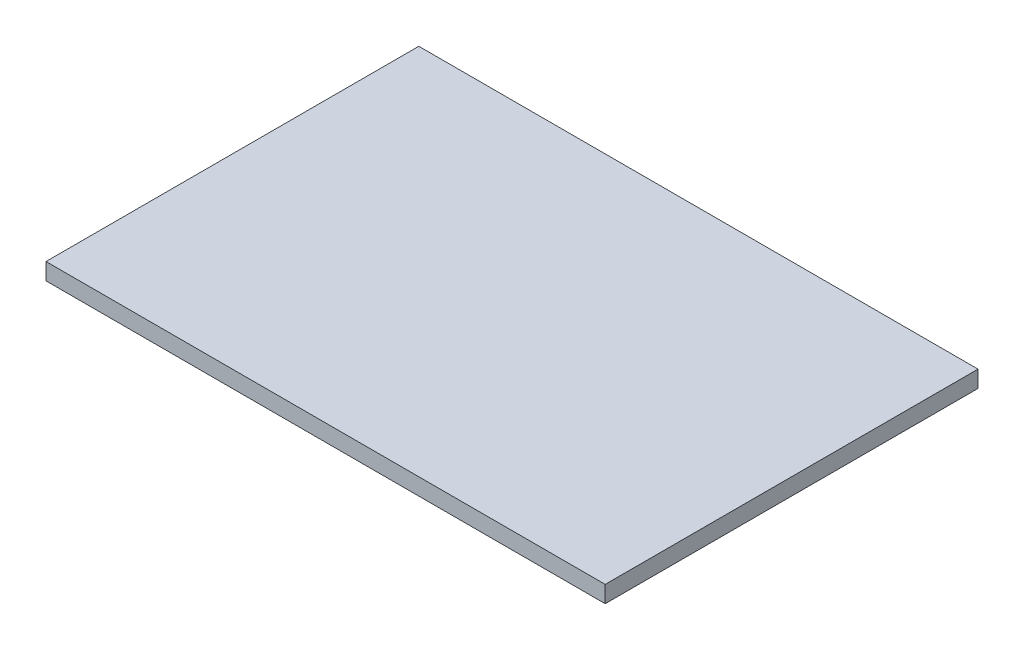
ISO-10303-21;
HEADER;
FILE_DESCRIPTION(('STEP AP214'),'2;1');
FILE_NAME('part.step','',(''),(''),'','','');
FILE_SCHEMA(('AUTOMOTIVE_DESIGN { 1 0 10303 214 1 1 1 1 }'));
ENDSEC;
DATA;
#1=APPLICATION_CONTEXT('core data for automotive mechanical design processes');
#2=APPLICATION_PROTOCOL_DEFINITION('international standard','automotive_design',2000,#1);
#3=PRODUCT_CONTEXT('',#1,'mechanical');
#4=PRODUCT('Part','Part','',(#3));
#5=PRODUCT_RELATED_PRODUCT_CATEGORY('part','',(#4));
#6=PRODUCT_DEFINITION_FORMATION('','',#4);
#7=PRODUCT_DEFINITION_CONTEXT('part definition',#1,'design');
#8=PRODUCT_DEFINITION('design','',#6,#7);
#9=PRODUCT_DEFINITION_SHAPE('','',#8);
#10=(LENGTH_UNIT() NAMED_UNIT(*) SI_UNIT(.MILLI.,.METRE.));
#11=(NAMED_UNIT(*) PLANE_ANGLE_UNIT() SI_UNIT($,.RADIAN.));
#12=(NAMED_UNIT(*) SI_UNIT($,.STERADIAN.) SOLID_ANGLE_UNIT());
#13=UNCERTAINTY_MEASURE_WITH_UNIT(LENGTH_MEASURE(1.E-05),#10,'distance_accuracy_value','');
#14=(GEOMETRIC_REPRESENTATION_CONTEXT(3) GLOBAL_UNCERTAINTY_ASSIGNED_CONTEXT((#13)) GLOBAL_UNIT_ASSIGNED_CONTEXT((#10,
#11,#12)) REPRESENTATION_CONTEXT('',''));
#15=CARTESIAN_POINT('',(0.,0.,0.));
#16=DIRECTION('',(0.,0.,1.));
#17=DIRECTION('',(1.,0.,0.));
#18=AXIS2_PLACEMENT_3D('',#15,#16,#17);
#19=CARTESIAN_POINT('',(150.,9.,-100.));
#20=DIRECTION('',(-1.,0.,0.));
#21=DIRECTION('',(0.,0.,1.));
#22=AXIS2_PLACEMENT_3D('',#19,#20,#21);
#23=PLANE('',#22);
#24=DIRECTION('',(0.,0.,-1.));
#25=VECTOR('',#24,1.);
#26=CARTESIAN_POINT('',(150.,0.,-100.));
#27=LINE('',#26,#25);
#28=CARTESIAN_POINT('',(150.,0.,100.));
#29=VERTEX_POINT('',#28);
#30=CARTESIAN_POINT('',(150.,0.,-100.));
#31=VERTEX_POINT('',#30);
#32=EDGE_CURVE('E108',#29,#31,#27,.T.);
#33=ORIENTED_EDGE('',*,*,#32,.T.);
#34=DIRECTION('',(0.,-1.,0.));
#35=VECTOR('',#34,1.);
#36=CARTESIAN_POINT('',(150.,9.,-100.));
#37=LINE('',#36,#35);
#38=CARTESIAN_POINT('',(150.,9.,-100.));
#39=VERTEX_POINT('',#38);
#40=EDGE_CURVE('E11',#39,#31,#37,.T.);
#41=ORIENTED_EDGE('',*,*,#40,.F.);
#42=DIRECTION('',(0.,0.,-1.));
#43=VECTOR('',#42,1.);
#44=CARTESIAN_POINT('',(150.,9.,-100.));
#45=LINE('',#44,#43);
#46=CARTESIAN_POINT('',(150.,9.,100.));
#47=VERTEX_POINT('',#46);
#48=EDGE_CURVE('E96',#47,#39,#45,.T.);
#49=ORIENTED_EDGE('',*,*,#48,.F.);
#50=DIRECTION('',(0.,-1.,0.));
#51=VECTOR('',#50,1.);
#52=CARTESIAN_POINT('',(150.,9.,100.));
#53=LINE('',#52,#51);
#54=EDGE_CURVE('E104',#47,#29,#53,.T.);
#55=ORIENTED_EDGE('',*,*,#54,.T.);
#56=EDGE_LOOP('',(#33,#41,#49,#55));
#57=FACE_BOUND('',#56,.T.);
#58=ADVANCED_FACE('F45',(#57),#23,.F.);
#59=CARTESIAN_POINT('',(-150.,9.,-100.));
#60=DIRECTION('',(0.,0.,1.));
#61=DIRECTION('',(1.,0.,0.));
#62=AXIS2_PLACEMENT_3D('',#59,#60,#61);
#63=PLANE('',#62);
#64=DIRECTION('',(-1.,0.,0.));
#65=VECTOR('',#64,1.);
#66=CARTESIAN_POINT('',(-150.,0.,-100.));
#67=LINE('',#66,#65);
#68=CARTESIAN_POINT('',(-150.,0.,-100.));
#69=VERTEX_POINT('',#68);
#70=EDGE_CURVE('E100',#31,#69,#67,.T.);
#71=ORIENTED_EDGE('',*,*,#70,.T.);
#72=DIRECTION('',(0.,-1.,0.));
#73=VECTOR('',#72,1.);
#74=CARTESIAN_POINT('',(-150.,9.,-100.));
#75=LINE('',#74,#73);
#76=CARTESIAN_POINT('',(-150.,9.,-100.));
#77=VERTEX_POINT('',#76);
#78=EDGE_CURVE('E53',#77,#69,#75,.T.);
#79=ORIENTED_EDGE('',*,*,#78,.F.);
#80=DIRECTION('',(-1.,0.,0.));
#81=VECTOR('',#80,1.);
#82=CARTESIAN_POINT('',(-150.,9.,-100.));
#83=LINE('',#82,#81);
#84=EDGE_CURVE('E91',#39,#77,#83,.T.);
#85=ORIENTED_EDGE('',*,*,#84,.F.);
#86=ORIENTED_EDGE('',*,*,#40,.T.);
#87=EDGE_LOOP('',(#71,#79,#85,#86));
#88=FACE_BOUND('',#87,.T.);
#89=ADVANCED_FACE('F99',(#88),#63,.F.);
#90=CARTESIAN_POINT('',(-150.,9.,-100.));
#91=DIRECTION('',(1.,0.,0.));
#92=DIRECTION('',(0.,0.,-1.));
#93=AXIS2_PLACEMENT_3D('',#90,#91,#92);
#94=PLANE('',#93);
#95=DIRECTION('',(0.,0.,1.));
#96=VECTOR('',#95,1.);
#97=CARTESIAN_POINT('',(-150.,0.,-100.));
#98=LINE('',#97,#96);
#99=CARTESIAN_POINT('',(-150.,0.,100.));
#100=VERTEX_POINT('',#99);
#101=EDGE_CURVE('E78',#69,#100,#98,.T.);
#102=ORIENTED_EDGE('',*,*,#101,.T.);
#103=DIRECTION('',(0.,-1.,0.));
#104=VECTOR('',#103,1.);
#105=CARTESIAN_POINT('',(-150.,9.,100.));
#106=LINE('',#105,#104);
#107=CARTESIAN_POINT('',(-150.,9.,100.));
#108=VERTEX_POINT('',#107);
#109=EDGE_CURVE('E101',#108,#100,#106,.T.);
#110=ORIENTED_EDGE('',*,*,#109,.F.);
#111=DIRECTION('',(0.,0.,1.));
#112=VECTOR('',#111,1.);
#113=CARTESIAN_POINT('',(-150.,9.,-100.));
#114=LINE('',#113,#112);
#115=EDGE_CURVE('E94',#77,#108,#114,.T.);
#116=ORIENTED_EDGE('',*,*,#115,.F.);
#117=ORIENTED_EDGE('',*,*,#78,.T.);
#118=EDGE_LOOP('',(#102,#110,#116,#117));
#119=FACE_BOUND('',#118,.T.);
#120=ADVANCED_FACE('F102',(#119),#94,.F.);
#121=CARTESIAN_POINT('',(-150.,9.,100.));
#122=DIRECTION('',(0.,0.,-1.));
#123=DIRECTION('',(-1.,0.,0.));
#124=AXIS2_PLACEMENT_3D('',#121,#122,#123);
#125=PLANE('',#124);
#126=DIRECTION('',(1.,0.,0.));
#127=VECTOR('',#126,1.);
#128=CARTESIAN_POINT('',(-150.,0.,100.));
#129=LINE('',#128,#127);
#130=EDGE_CURVE('E84',#100,#29,#129,.T.);
#131=ORIENTED_EDGE('',*,*,#130,.T.);
#132=ORIENTED_EDGE('',*,*,#54,.F.);
#133=DIRECTION('',(1.,0.,0.));
#134=VECTOR('',#133,1.);
#135=CARTESIAN_POINT('',(-150.,9.,100.));
#136=LINE('',#135,#134);
#137=EDGE_CURVE('E61',#108,#47,#136,.T.);
#138=ORIENTED_EDGE('',*,*,#137,.F.);
#139=ORIENTED_EDGE('',*,*,#109,.T.);
#140=EDGE_LOOP('',(#131,#132,#138,#139));
#141=FACE_BOUND('',#140,.T.);
#142=ADVANCED_FACE('F115',(#141),#125,.F.);
#143=CARTESIAN_POINT('',(0.,9.,0.));
#144=DIRECTION('',(0.,1.,0.));
#145=DIRECTION('',(0.,0.,1.));
#146=AXIS2_PLACEMENT_3D('',#143,#144,#145);
#147=PLANE('',#146);
#148=ORIENTED_EDGE('',*,*,#48,.T.);
#149=ORIENTED_EDGE('',*,*,#84,.T.);
#150=ORIENTED_EDGE('',*,*,#115,.T.);
#151=ORIENTED_EDGE('',*,*,#137,.T.);
#152=EDGE_LOOP('',(#148,#149,#150,#151));
#153=FACE_BOUND('',#152,.T.);
#154=ADVANCED_FACE('F92',(#153),#147,.T.);
#155=CARTESIAN_POINT('',(0.,0.,0.));
#156=DIRECTION('',(0.,1.,0.));
#157=DIRECTION('',(0.,0.,1.));
#158=AXIS2_PLACEMENT_3D('',#155,#156,#157);
#159=PLANE('',#158);
#160=ORIENTED_EDGE('',*,*,#32,.F.);
#161=ORIENTED_EDGE('',*,*,#130,.F.);
#162=ORIENTED_EDGE('',*,*,#101,.F.);
#163=ORIENTED_EDGE('',*,*,#70,.F.);
#164=EDGE_LOOP('',(#160,#161,#162,#163));
#165=FACE_BOUND('',#164,.T.);
#166=ADVANCED_FACE('F118',(#165),#159,.F.);
#167=CLOSED_SHELL('',(#58,#89,#120,#142,#154,#166));
#168=MANIFOLD_SOLID_BREP('B2',#167);
#169=ADVANCED_BREP_SHAPE_REPRESENTATION('',(#18,#168),#14);
#170=SHAPE_DEFINITION_REPRESENTATION(#9,#169);
ENDSEC;
END-ISO-10303-21;
